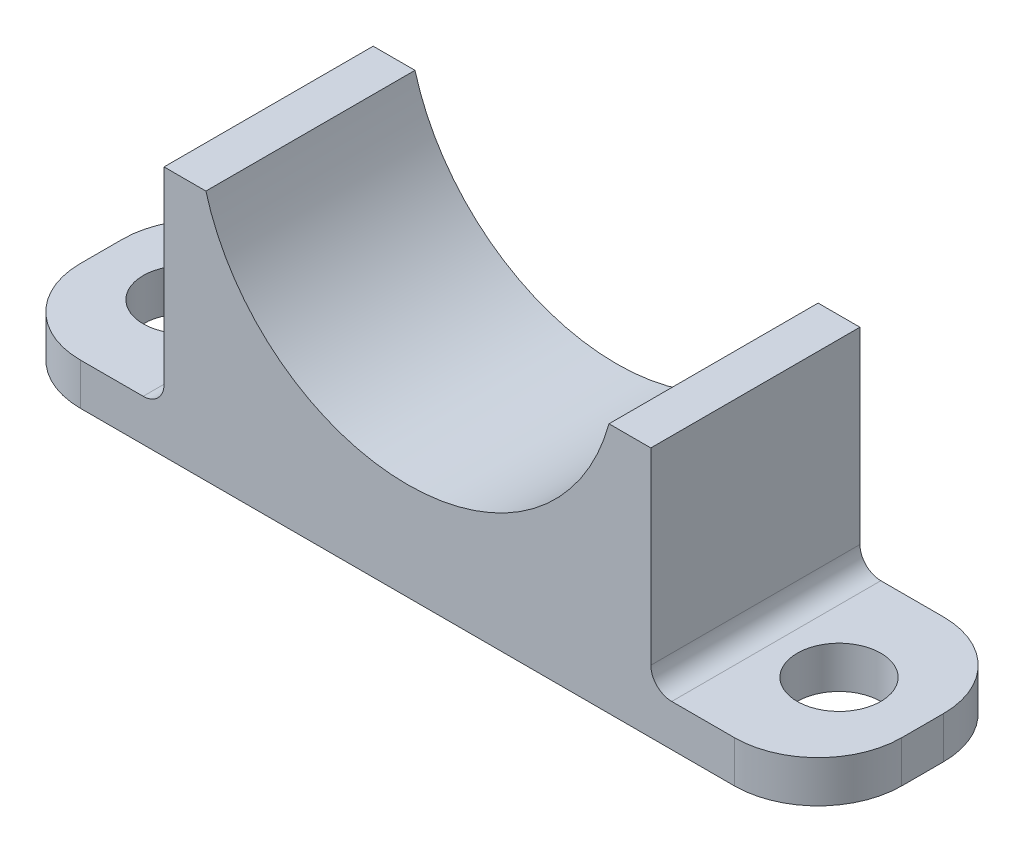
ISO-10303-21;
HEADER;
FILE_DESCRIPTION(('STEP AP214'),'2;1');
FILE_NAME('part.step','',(''),(''),'','','');
FILE_SCHEMA(('AUTOMOTIVE_DESIGN { 1 0 10303 214 1 1 1 1 }'));
ENDSEC;
DATA;
#1=APPLICATION_CONTEXT('core data for automotive mechanical design processes');
#2=APPLICATION_PROTOCOL_DEFINITION('international standard','automotive_design',2000,#1);
#3=PRODUCT_CONTEXT('',#1,'mechanical');
#4=PRODUCT('Part','Part','',(#3));
#5=PRODUCT_RELATED_PRODUCT_CATEGORY('part','',(#4));
#6=PRODUCT_DEFINITION_FORMATION('','',#4);
#7=PRODUCT_DEFINITION_CONTEXT('part definition',#1,'design');
#8=PRODUCT_DEFINITION('design','',#6,#7);
#9=PRODUCT_DEFINITION_SHAPE('','',#8);
#10=(LENGTH_UNIT() NAMED_UNIT(*) SI_UNIT(.MILLI.,.METRE.));
#11=(NAMED_UNIT(*) PLANE_ANGLE_UNIT() SI_UNIT($,.RADIAN.));
#12=(NAMED_UNIT(*) SI_UNIT($,.STERADIAN.) SOLID_ANGLE_UNIT());
#13=UNCERTAINTY_MEASURE_WITH_UNIT(LENGTH_MEASURE(1.E-05),#10,'distance_accuracy_value','');
#14=(GEOMETRIC_REPRESENTATION_CONTEXT(3) GLOBAL_UNCERTAINTY_ASSIGNED_CONTEXT((#13)) GLOBAL_UNIT_ASSIGNED_CONTEXT((#10,
#11,#12)) REPRESENTATION_CONTEXT('',''));
#15=CARTESIAN_POINT('',(0.,0.,0.));
#16=DIRECTION('',(0.,0.,1.));
#17=DIRECTION('',(1.,0.,0.));
#18=AXIS2_PLACEMENT_3D('',#15,#16,#17);
#19=CARTESIAN_POINT('',(31.59757972097,-29.1563241801685,25.));
#20=DIRECTION('',(0.,0.,1.));
#21=DIRECTION('',(1.,0.,0.));
#22=AXIS2_PLACEMENT_3D('',#19,#20,#21);
#23=CYLINDRICAL_SURFACE('',#22,2.5);
#24=DIRECTION('',(0.,0.,-1.));
#25=VECTOR('',#24,1.);
#26=CARTESIAN_POINT('',(29.09757972097,-29.1563241801685,25.));
#27=LINE('',#26,#25);
#28=CARTESIAN_POINT('',(29.09757972097,-29.1563241801685,25.));
#29=VERTEX_POINT('',#28);
#30=CARTESIAN_POINT('',(29.09757972097,-29.1563241801685,0.));
#31=VERTEX_POINT('',#30);
#32=EDGE_CURVE('E227',#29,#31,#27,.T.);
#33=ORIENTED_EDGE('',*,*,#32,.F.);
#34=CARTESIAN_POINT('',(31.59757972097,-29.1563241801685,25.));
#35=DIRECTION('',(0.,0.,1.));
#36=DIRECTION('',(1.,0.,0.));
#37=AXIS2_PLACEMENT_3D('',#34,#35,#36);
#38=CIRCLE('',#37,2.5);
#39=CARTESIAN_POINT('',(31.59757972097,-31.6563241801685,25.));
#40=VERTEX_POINT('',#39);
#41=EDGE_CURVE('E41',#29,#40,#38,.T.);
#42=ORIENTED_EDGE('',*,*,#41,.T.);
#43=DIRECTION('',(0.,0.,-1.));
#44=VECTOR('',#43,1.);
#45=CARTESIAN_POINT('',(31.59757972097,-31.6563241801685,25.));
#46=LINE('',#45,#44);
#47=CARTESIAN_POINT('',(31.59757972097,-31.6563241801685,0.));
#48=VERTEX_POINT('',#47);
#49=EDGE_CURVE('E230',#48,#40,#46,.F.);
#50=ORIENTED_EDGE('',*,*,#49,.F.);
#51=CARTESIAN_POINT('',(31.59757972097,-29.1563241801685,0.));
#52=DIRECTION('',(0.,0.,1.));
#53=DIRECTION('',(1.,0.,0.));
#54=AXIS2_PLACEMENT_3D('',#51,#52,#53);
#55=CIRCLE('',#54,2.5);
#56=EDGE_CURVE('E11',#48,#31,#55,.F.);
#57=ORIENTED_EDGE('',*,*,#56,.T.);
#58=EDGE_LOOP('',(#33,#42,#50,#57));
#59=FACE_BOUND('',#58,.T.);
#60=ADVANCED_FACE('F34',(#59),#23,.F.);
#61=CARTESIAN_POINT('',(-31.59757972097,-29.1563241801685,25.));
#62=DIRECTION('',(0.,0.,-1.));
#63=DIRECTION('',(-1.,0.,0.));
#64=AXIS2_PLACEMENT_3D('',#61,#62,#63);
#65=CYLINDRICAL_SURFACE('',#64,2.5);
#66=DIRECTION('',(0.,0.,1.));
#67=VECTOR('',#66,1.);
#68=CARTESIAN_POINT('',(-29.09757972097,-29.1563241801685,25.));
#69=LINE('',#68,#67);
#70=CARTESIAN_POINT('',(-29.09757972097,-29.1563241801685,0.));
#71=VERTEX_POINT('',#70);
#72=CARTESIAN_POINT('',(-29.09757972097,-29.1563241801685,25.));
#73=VERTEX_POINT('',#72);
#74=EDGE_CURVE('E217',#71,#73,#69,.T.);
#75=ORIENTED_EDGE('',*,*,#74,.F.);
#76=CARTESIAN_POINT('',(-31.59757972097,-29.1563241801685,0.));
#77=DIRECTION('',(0.,0.,1.));
#78=DIRECTION('',(1.,0.,0.));
#79=AXIS2_PLACEMENT_3D('',#76,#77,#78);
#80=CIRCLE('',#79,2.5);
#81=CARTESIAN_POINT('',(-31.59757972097,-31.6563241801685,0.));
#82=VERTEX_POINT('',#81);
#83=EDGE_CURVE('E223',#71,#82,#80,.F.);
#84=ORIENTED_EDGE('',*,*,#83,.T.);
#85=DIRECTION('',(0.,0.,1.));
#86=VECTOR('',#85,1.);
#87=CARTESIAN_POINT('',(-31.59757972097,-31.6563241801685,25.));
#88=LINE('',#87,#86);
#89=CARTESIAN_POINT('',(-31.59757972097,-31.6563241801685,25.));
#90=VERTEX_POINT('',#89);
#91=EDGE_CURVE('E220',#90,#82,#88,.F.);
#92=ORIENTED_EDGE('',*,*,#91,.F.);
#93=CARTESIAN_POINT('',(-31.59757972097,-29.1563241801685,25.));
#94=DIRECTION('',(0.,0.,1.));
#95=DIRECTION('',(1.,0.,0.));
#96=AXIS2_PLACEMENT_3D('',#93,#94,#95);
#97=CIRCLE('',#96,2.5);
#98=EDGE_CURVE('E225',#90,#73,#97,.T.);
#99=ORIENTED_EDGE('',*,*,#98,.T.);
#100=EDGE_LOOP('',(#75,#84,#92,#99));
#101=FACE_BOUND('',#100,.T.);
#102=ADVANCED_FACE('F292',(#101),#65,.F.);
#103=CARTESIAN_POINT('',(39.09757972097,0.,10.));
#104=DIRECTION('',(0.,-1.,0.));
#105=DIRECTION('',(0.,0.,-1.));
#106=AXIS2_PLACEMENT_3D('',#103,#104,#105);
#107=CYLINDRICAL_SURFACE('',#106,10.);
#108=DIRECTION('',(0.,-1.,0.));
#109=VECTOR('',#108,1.);
#110=CARTESIAN_POINT('',(39.09757972097,0.,0.));
#111=LINE('',#110,#109);
#112=CARTESIAN_POINT('',(39.09757972097,-31.6563241801685,0.));
#113=VERTEX_POINT('',#112);
#114=CARTESIAN_POINT('',(39.09757972097,-36.6563241801685,0.));
#115=VERTEX_POINT('',#114);
#116=EDGE_CURVE('E207',#113,#115,#111,.T.);
#117=ORIENTED_EDGE('',*,*,#116,.F.);
#118=CARTESIAN_POINT('',(39.09757972097,-31.6563241801685,10.));
#119=DIRECTION('',(0.,-1.,0.));
#120=DIRECTION('',(1.,0.,0.));
#121=AXIS2_PLACEMENT_3D('',#118,#119,#120);
#122=CIRCLE('',#121,10.);
#123=CARTESIAN_POINT('',(49.09757972097,-31.6563241801685,10.));
#124=VERTEX_POINT('',#123);
#125=EDGE_CURVE('E213',#124,#113,#122,.F.);
#126=ORIENTED_EDGE('',*,*,#125,.F.);
#127=DIRECTION('',(0.,-1.,0.));
#128=VECTOR('',#127,1.);
#129=CARTESIAN_POINT('',(49.09757972097,0.,10.));
#130=LINE('',#129,#128);
#131=CARTESIAN_POINT('',(49.09757972097,-36.6563241801685,10.));
#132=VERTEX_POINT('',#131);
#133=EDGE_CURVE('E210',#132,#124,#130,.F.);
#134=ORIENTED_EDGE('',*,*,#133,.F.);
#135=CARTESIAN_POINT('',(39.09757972097,-36.6563241801685,10.));
#136=DIRECTION('',(0.,1.,0.));
#137=DIRECTION('',(-1.,0.,0.));
#138=AXIS2_PLACEMENT_3D('',#135,#136,#137);
#139=CIRCLE('',#138,10.);
#140=EDGE_CURVE('E215',#115,#132,#139,.F.);
#141=ORIENTED_EDGE('',*,*,#140,.F.);
#142=EDGE_LOOP('',(#117,#126,#134,#141));
#143=FACE_BOUND('',#142,.T.);
#144=ADVANCED_FACE('F316',(#143),#107,.T.);
#145=CARTESIAN_POINT('',(39.09757972097,0.,15.));
#146=DIRECTION('',(0.,-1.,0.));
#147=DIRECTION('',(0.,0.,-1.));
#148=AXIS2_PLACEMENT_3D('',#145,#146,#147);
#149=CYLINDRICAL_SURFACE('',#148,10.);
#150=DIRECTION('',(0.,1.,0.));
#151=VECTOR('',#150,1.);
#152=CARTESIAN_POINT('',(39.09757972097,0.,25.));
#153=LINE('',#152,#151);
#154=CARTESIAN_POINT('',(39.09757972097,-36.6563241801685,25.));
#155=VERTEX_POINT('',#154);
#156=CARTESIAN_POINT('',(39.09757972097,-31.6563241801685,25.));
#157=VERTEX_POINT('',#156);
#158=EDGE_CURVE('E196',#155,#157,#153,.T.);
#159=ORIENTED_EDGE('',*,*,#158,.F.);
#160=CARTESIAN_POINT('',(39.09757972097,-36.6563241801685,15.));
#161=DIRECTION('',(0.,1.,0.));
#162=DIRECTION('',(-1.,0.,0.));
#163=AXIS2_PLACEMENT_3D('',#160,#161,#162);
#164=CIRCLE('',#163,10.);
#165=CARTESIAN_POINT('',(49.09757972097,-36.6563241801685,15.));
#166=VERTEX_POINT('',#165);
#167=EDGE_CURVE('E202',#166,#155,#164,.F.);
#168=ORIENTED_EDGE('',*,*,#167,.F.);
#169=DIRECTION('',(0.,1.,0.));
#170=VECTOR('',#169,1.);
#171=CARTESIAN_POINT('',(49.09757972097,0.,15.));
#172=LINE('',#171,#170);
#173=CARTESIAN_POINT('',(49.09757972097,-31.6563241801685,15.));
#174=VERTEX_POINT('',#173);
#175=EDGE_CURVE('E199',#174,#166,#172,.F.);
#176=ORIENTED_EDGE('',*,*,#175,.F.);
#177=CARTESIAN_POINT('',(39.09757972097,-31.6563241801685,15.));
#178=DIRECTION('',(0.,-1.,0.));
#179=DIRECTION('',(1.,0.,0.));
#180=AXIS2_PLACEMENT_3D('',#177,#178,#179);
#181=CIRCLE('',#180,10.);
#182=EDGE_CURVE('E204',#157,#174,#181,.F.);
#183=ORIENTED_EDGE('',*,*,#182,.F.);
#184=EDGE_LOOP('',(#159,#168,#176,#183));
#185=FACE_BOUND('',#184,.T.);
#186=ADVANCED_FACE('F309',(#185),#149,.T.);
#187=CARTESIAN_POINT('',(29.09757972097,-6.6563241801685,25.));
#188=DIRECTION('',(-1.,0.,0.));
#189=DIRECTION('',(0.,-1.,0.));
#190=AXIS2_PLACEMENT_3D('',#187,#188,#189);
#191=PLANE('',#190);
#192=DIRECTION('',(0.,1.,0.));
#193=VECTOR('',#192,1.);
#194=CARTESIAN_POINT('',(29.09757972097,-6.6563241801685,25.));
#195=LINE('',#194,#193);
#196=CARTESIAN_POINT('',(29.09757972097,-6.6563241801685,25.));
#197=VERTEX_POINT('',#196);
#198=EDGE_CURVE('E261',#29,#197,#195,.T.);
#199=ORIENTED_EDGE('',*,*,#198,.F.);
#200=ORIENTED_EDGE('',*,*,#32,.T.);
#201=DIRECTION('',(0.,1.,0.));
#202=VECTOR('',#201,1.);
#203=CARTESIAN_POINT('',(29.09757972097,-6.6563241801685,0.));
#204=LINE('',#203,#202);
#205=CARTESIAN_POINT('',(29.09757972097,-6.6563241801685,0.));
#206=VERTEX_POINT('',#205);
#207=EDGE_CURVE('E274',#31,#206,#204,.T.);
#208=ORIENTED_EDGE('',*,*,#207,.T.);
#209=DIRECTION('',(0.,0.,-1.));
#210=VECTOR('',#209,1.);
#211=CARTESIAN_POINT('',(29.09757972097,-6.6563241801685,25.));
#212=LINE('',#211,#210);
#213=EDGE_CURVE('E175',#197,#206,#212,.T.);
#214=ORIENTED_EDGE('',*,*,#213,.F.);
#215=EDGE_LOOP('',(#199,#200,#208,#214));
#216=FACE_BOUND('',#215,.T.);
#217=ADVANCED_FACE('F338',(#216),#191,.F.);
#218=CARTESIAN_POINT('',(-39.09757972097,0.,10.));
#219=DIRECTION('',(0.,1.,0.));
#220=DIRECTION('',(0.,0.,1.));
#221=AXIS2_PLACEMENT_3D('',#218,#219,#220);
#222=CYLINDRICAL_SURFACE('',#221,10.);
#223=DIRECTION('',(0.,1.,0.));
#224=VECTOR('',#223,1.);
#225=CARTESIAN_POINT('',(-39.09757972097,0.,0.));
#226=LINE('',#225,#224);
#227=CARTESIAN_POINT('',(-39.09757972097,-36.6563241801685,0.));
#228=VERTEX_POINT('',#227);
#229=CARTESIAN_POINT('',(-39.09757972097,-31.6563241801685,0.));
#230=VERTEX_POINT('',#229);
#231=EDGE_CURVE('E186',#228,#230,#226,.T.);
#232=ORIENTED_EDGE('',*,*,#231,.F.);
#233=CARTESIAN_POINT('',(-39.09757972097,-36.6563241801685,10.));
#234=DIRECTION('',(0.,1.,0.));
#235=DIRECTION('',(-1.,0.,0.));
#236=AXIS2_PLACEMENT_3D('',#233,#234,#235);
#237=CIRCLE('',#236,10.);
#238=CARTESIAN_POINT('',(-49.09757972097,-36.6563241801685,10.));
#239=VERTEX_POINT('',#238);
#240=EDGE_CURVE('E192',#239,#228,#237,.F.);
#241=ORIENTED_EDGE('',*,*,#240,.F.);
#242=DIRECTION('',(0.,1.,0.));
#243=VECTOR('',#242,1.);
#244=CARTESIAN_POINT('',(-49.09757972097,0.,10.));
#245=LINE('',#244,#243);
#246=CARTESIAN_POINT('',(-49.09757972097,-31.6563241801685,10.));
#247=VERTEX_POINT('',#246);
#248=EDGE_CURVE('E189',#247,#239,#245,.F.);
#249=ORIENTED_EDGE('',*,*,#248,.F.);
#250=CARTESIAN_POINT('',(-39.09757972097,-31.6563241801685,10.));
#251=DIRECTION('',(0.,-1.,0.));
#252=DIRECTION('',(0.,0.,-1.));
#253=AXIS2_PLACEMENT_3D('',#250,#251,#252);
#254=CIRCLE('',#253,10.);
#255=EDGE_CURVE('E194',#230,#247,#254,.F.);
#256=ORIENTED_EDGE('',*,*,#255,.F.);
#257=EDGE_LOOP('',(#232,#241,#249,#256));
#258=FACE_BOUND('',#257,.T.);
#259=ADVANCED_FACE('F321',(#258),#222,.T.);
#260=CARTESIAN_POINT('',(-39.09757972097,0.,15.));
#261=DIRECTION('',(0.,1.,0.));
#262=DIRECTION('',(0.,0.,1.));
#263=AXIS2_PLACEMENT_3D('',#260,#261,#262);
#264=CYLINDRICAL_SURFACE('',#263,10.);
#265=DIRECTION('',(0.,-1.,0.));
#266=VECTOR('',#265,1.);
#267=CARTESIAN_POINT('',(-39.09757972097,0.,25.));
#268=LINE('',#267,#266);
#269=CARTESIAN_POINT('',(-39.09757972097,-31.6563241801685,25.));
#270=VERTEX_POINT('',#269);
#271=CARTESIAN_POINT('',(-39.09757972097,-36.6563241801685,25.));
#272=VERTEX_POINT('',#271);
#273=EDGE_CURVE('E170',#270,#272,#268,.T.);
#274=ORIENTED_EDGE('',*,*,#273,.F.);
#275=CARTESIAN_POINT('',(-39.09757972097,-31.6563241801685,15.));
#276=DIRECTION('',(0.,-1.,0.));
#277=DIRECTION('',(0.,0.,-1.));
#278=AXIS2_PLACEMENT_3D('',#275,#276,#277);
#279=CIRCLE('',#278,10.);
#280=CARTESIAN_POINT('',(-49.09757972097,-31.6563241801685,15.));
#281=VERTEX_POINT('',#280);
#282=EDGE_CURVE('E181',#281,#270,#279,.F.);
#283=ORIENTED_EDGE('',*,*,#282,.F.);
#284=DIRECTION('',(0.,-1.,0.));
#285=VECTOR('',#284,1.);
#286=CARTESIAN_POINT('',(-49.09757972097,0.,15.));
#287=LINE('',#286,#285);
#288=CARTESIAN_POINT('',(-49.09757972097,-36.6563241801685,15.));
#289=VERTEX_POINT('',#288);
#290=EDGE_CURVE('E173',#289,#281,#287,.F.);
#291=ORIENTED_EDGE('',*,*,#290,.F.);
#292=CARTESIAN_POINT('',(-39.09757972097,-36.6563241801685,15.));
#293=DIRECTION('',(0.,1.,0.));
#294=DIRECTION('',(-1.,0.,0.));
#295=AXIS2_PLACEMENT_3D('',#292,#293,#294);
#296=CIRCLE('',#295,10.);
#297=EDGE_CURVE('E183',#272,#289,#296,.F.);
#298=ORIENTED_EDGE('',*,*,#297,.F.);
#299=EDGE_LOOP('',(#274,#283,#291,#298));
#300=FACE_BOUND('',#299,.T.);
#301=ADVANCED_FACE('F300',(#300),#264,.T.);
#302=CARTESIAN_POINT('',(-29.09757972097,-36.6563241801685,25.));
#303=DIRECTION('',(1.,0.,0.));
#304=DIRECTION('',(0.,0.,-1.));
#305=AXIS2_PLACEMENT_3D('',#302,#303,#304);
#306=PLANE('',#305);
#307=DIRECTION('',(0.,-1.,0.));
#308=VECTOR('',#307,1.);
#309=CARTESIAN_POINT('',(-29.09757972097,-36.6563241801685,0.));
#310=LINE('',#309,#308);
#311=CARTESIAN_POINT('',(-29.09757972097,-6.6563241801685,0.));
#312=VERTEX_POINT('',#311);
#313=EDGE_CURVE('E268',#312,#71,#310,.T.);
#314=ORIENTED_EDGE('',*,*,#313,.T.);
#315=ORIENTED_EDGE('',*,*,#74,.T.);
#316=DIRECTION('',(0.,-1.,0.));
#317=VECTOR('',#316,1.);
#318=CARTESIAN_POINT('',(-29.09757972097,-36.6563241801685,25.));
#319=LINE('',#318,#317);
#320=CARTESIAN_POINT('',(-29.09757972097,-6.6563241801685,25.));
#321=VERTEX_POINT('',#320);
#322=EDGE_CURVE('E155',#321,#73,#319,.T.);
#323=ORIENTED_EDGE('',*,*,#322,.F.);
#324=DIRECTION('',(0.,0.,-1.));
#325=VECTOR('',#324,1.);
#326=CARTESIAN_POINT('',(-29.09757972097,-6.6563241801685,25.));
#327=LINE('',#326,#325);
#328=EDGE_CURVE('E151',#321,#312,#327,.T.);
#329=ORIENTED_EDGE('',*,*,#328,.T.);
#330=EDGE_LOOP('',(#314,#315,#323,#329));
#331=FACE_BOUND('',#330,.T.);
#332=ADVANCED_FACE('F287',(#331),#306,.F.);
#333=CARTESIAN_POINT('',(0.,0.,25.));
#334=DIRECTION('',(0.,0.,-1.));
#335=DIRECTION('',(-1.,0.,0.));
#336=AXIS2_PLACEMENT_3D('',#333,#334,#335);
#337=CYLINDRICAL_SURFACE('',#336,25.);
#338=CARTESIAN_POINT('',(0.,0.,0.));
#339=DIRECTION('',(0.,0.,-1.));
#340=DIRECTION('',(1.,0.,0.));
#341=AXIS2_PLACEMENT_3D('',#338,#339,#340);
#342=CIRCLE('',#341,25.);
#343=CARTESIAN_POINT('',(24.09757972097,-6.6563241801685,0.));
#344=VERTEX_POINT('',#343);
#345=CARTESIAN_POINT('',(-24.09757972097,-6.6563241801685,0.));
#346=VERTEX_POINT('',#345);
#347=EDGE_CURVE('E169',#344,#346,#342,.T.);
#348=ORIENTED_EDGE('',*,*,#347,.T.);
#349=DIRECTION('',(0.,0.,-1.));
#350=VECTOR('',#349,1.);
#351=CARTESIAN_POINT('',(-24.09757972097,-6.6563241801685,25.));
#352=LINE('',#351,#350);
#353=CARTESIAN_POINT('',(-24.09757972097,-6.6563241801685,25.));
#354=VERTEX_POINT('',#353);
#355=EDGE_CURVE('E148',#354,#346,#352,.T.);
#356=ORIENTED_EDGE('',*,*,#355,.F.);
#357=CARTESIAN_POINT('',(0.,0.,25.));
#358=DIRECTION('',(0.,0.,-1.));
#359=DIRECTION('',(1.,0.,0.));
#360=AXIS2_PLACEMENT_3D('',#357,#358,#359);
#361=CIRCLE('',#360,25.);
#362=CARTESIAN_POINT('',(24.09757972097,-6.6563241801685,25.));
#363=VERTEX_POINT('',#362);
#364=EDGE_CURVE('E156',#363,#354,#361,.T.);
#365=ORIENTED_EDGE('',*,*,#364,.F.);
#366=DIRECTION('',(0.,0.,-1.));
#367=VECTOR('',#366,1.);
#368=CARTESIAN_POINT('',(24.09757972097,-6.6563241801685,25.));
#369=LINE('',#368,#367);
#370=EDGE_CURVE('E264',#363,#344,#369,.T.);
#371=ORIENTED_EDGE('',*,*,#370,.T.);
#372=EDGE_LOOP('',(#348,#356,#365,#371));
#373=FACE_BOUND('',#372,.T.);
#374=ADVANCED_FACE('F167',(#373),#337,.F.);
#375=CARTESIAN_POINT('',(-29.09757972097,-6.6563241801685,25.));
#376=DIRECTION('',(0.,-1.,0.));
#377=DIRECTION('',(0.,0.,-1.));
#378=AXIS2_PLACEMENT_3D('',#375,#376,#377);
#379=PLANE('',#378);
#380=DIRECTION('',(-1.,0.,0.));
#381=VECTOR('',#380,1.);
#382=CARTESIAN_POINT('',(-29.09757972097,-6.6563241801685,0.));
#383=LINE('',#382,#381);
#384=EDGE_CURVE('E266',#346,#312,#383,.T.);
#385=ORIENTED_EDGE('',*,*,#384,.T.);
#386=ORIENTED_EDGE('',*,*,#328,.F.);
#387=DIRECTION('',(-1.,0.,0.));
#388=VECTOR('',#387,1.);
#389=CARTESIAN_POINT('',(-29.09757972097,-6.6563241801685,25.));
#390=LINE('',#389,#388);
#391=EDGE_CURVE('E144',#354,#321,#390,.T.);
#392=ORIENTED_EDGE('',*,*,#391,.F.);
#393=ORIENTED_EDGE('',*,*,#355,.T.);
#394=EDGE_LOOP('',(#385,#386,#392,#393));
#395=FACE_BOUND('',#394,.T.);
#396=ADVANCED_FACE('F146',(#395),#379,.F.);
#397=CARTESIAN_POINT('',(29.09757972097,-36.6563241801685,25.));
#398=DIRECTION('',(0.,1.,0.));
#399=DIRECTION('',(-1.,0.,0.));
#400=AXIS2_PLACEMENT_3D('',#397,#398,#399);
#401=PLANE('',#400);
#402=CARTESIAN_POINT('',(39.09757972097,-36.6563241801685,12.5));
#403=DIRECTION('',(0.,1.,0.));
#404=DIRECTION('',(-1.,0.,0.));
#405=AXIS2_PLACEMENT_3D('',#402,#403,#404);
#406=CIRCLE('',#405,5.);
#407=CARTESIAN_POINT('',(34.09757972097,-36.6563241801685,12.5));
#408=VERTEX_POINT('',#407);
#409=EDGE_CURVE('E498',#408,#408,#406,.T.);
#410=ORIENTED_EDGE('',*,*,#409,.T.);
#411=EDGE_LOOP('',(#410));
#412=FACE_BOUND('',#411,.T.);
#413=CARTESIAN_POINT('',(-39.09757972097,-36.6563241801685,12.5));
#414=DIRECTION('',(0.,1.,0.));
#415=DIRECTION('',(-1.,0.,0.));
#416=AXIS2_PLACEMENT_3D('',#413,#414,#415);
#417=CIRCLE('',#416,5.);
#418=CARTESIAN_POINT('',(-44.09757972097,-36.6563241801685,12.5));
#419=VERTEX_POINT('',#418);
#420=EDGE_CURVE('E496',#419,#419,#417,.T.);
#421=ORIENTED_EDGE('',*,*,#420,.T.);
#422=EDGE_LOOP('',(#421));
#423=FACE_BOUND('',#422,.T.);
#424=DIRECTION('',(1.,0.,0.));
#425=VECTOR('',#424,1.);
#426=CARTESIAN_POINT('',(29.09757972097,-36.6563241801685,0.));
#427=LINE('',#426,#425);
#428=EDGE_CURVE('E271',#228,#115,#427,.T.);
#429=ORIENTED_EDGE('',*,*,#428,.T.);
#430=ORIENTED_EDGE('',*,*,#140,.T.);
#431=DIRECTION('',(0.,0.,-1.));
#432=VECTOR('',#431,1.);
#433=CARTESIAN_POINT('',(49.09757972097,-36.6563241801685,25.));
#434=LINE('',#433,#432);
#435=EDGE_CURVE('E244',#166,#132,#434,.T.);
#436=ORIENTED_EDGE('',*,*,#435,.F.);
#437=ORIENTED_EDGE('',*,*,#167,.T.);
#438=DIRECTION('',(1.,0.,0.));
#439=VECTOR('',#438,1.);
#440=CARTESIAN_POINT('',(29.09757972097,-36.6563241801685,25.));
#441=LINE('',#440,#439);
#442=EDGE_CURVE('E259',#272,#155,#441,.T.);
#443=ORIENTED_EDGE('',*,*,#442,.F.);
#444=ORIENTED_EDGE('',*,*,#297,.T.);
#445=DIRECTION('',(0.,0.,1.));
#446=VECTOR('',#445,1.);
#447=CARTESIAN_POINT('',(-49.09757972097,-36.6563241801685,0.));
#448=LINE('',#447,#446);
#449=EDGE_CURVE('E242',#239,#289,#448,.T.);
#450=ORIENTED_EDGE('',*,*,#449,.F.);
#451=ORIENTED_EDGE('',*,*,#240,.T.);
#452=EDGE_LOOP('',(#429,#430,#436,#437,#443,#444,#450,#451));
#453=FACE_BOUND('',#452,.T.);
#454=ADVANCED_FACE('F303',(#412,#423,#453),#401,.F.);
#455=CARTESIAN_POINT('',(24.09757972097,-6.6563241801685,25.));
#456=DIRECTION('',(0.,-1.,0.));
#457=DIRECTION('',(0.,0.,-1.));
#458=AXIS2_PLACEMENT_3D('',#455,#456,#457);
#459=PLANE('',#458);
#460=DIRECTION('',(-1.,0.,0.));
#461=VECTOR('',#460,1.);
#462=CARTESIAN_POINT('',(24.09757972097,-6.6563241801685,0.));
#463=LINE('',#462,#461);
#464=EDGE_CURVE('E165',#206,#344,#463,.T.);
#465=ORIENTED_EDGE('',*,*,#464,.T.);
#466=ORIENTED_EDGE('',*,*,#370,.F.);
#467=DIRECTION('',(-1.,0.,0.));
#468=VECTOR('',#467,1.);
#469=CARTESIAN_POINT('',(24.09757972097,-6.6563241801685,25.));
#470=LINE('',#469,#468);
#471=EDGE_CURVE('E161',#197,#363,#470,.T.);
#472=ORIENTED_EDGE('',*,*,#471,.F.);
#473=ORIENTED_EDGE('',*,*,#213,.T.);
#474=EDGE_LOOP('',(#465,#466,#472,#473));
#475=FACE_BOUND('',#474,.T.);
#476=ADVANCED_FACE('F281',(#475),#459,.F.);
#477=CARTESIAN_POINT('',(0.,0.,25.));
#478=DIRECTION('',(0.,0.,1.));
#479=DIRECTION('',(1.,0.,0.));
#480=AXIS2_PLACEMENT_3D('',#477,#478,#479);
#481=PLANE('',#480);
#482=ORIENTED_EDGE('',*,*,#41,.F.);
#483=ORIENTED_EDGE('',*,*,#198,.T.);
#484=ORIENTED_EDGE('',*,*,#471,.T.);
#485=ORIENTED_EDGE('',*,*,#364,.T.);
#486=ORIENTED_EDGE('',*,*,#391,.T.);
#487=ORIENTED_EDGE('',*,*,#322,.T.);
#488=ORIENTED_EDGE('',*,*,#98,.F.);
#489=DIRECTION('',(1.,0.,0.));
#490=VECTOR('',#489,1.);
#491=CARTESIAN_POINT('',(-49.09757972097,-31.6563241801685,25.));
#492=LINE('',#491,#490);
#493=EDGE_CURVE('E255',#270,#90,#492,.T.);
#494=ORIENTED_EDGE('',*,*,#493,.F.);
#495=ORIENTED_EDGE('',*,*,#273,.T.);
#496=ORIENTED_EDGE('',*,*,#442,.T.);
#497=ORIENTED_EDGE('',*,*,#158,.T.);
#498=DIRECTION('',(-1.,0.,0.));
#499=VECTOR('',#498,1.);
#500=CARTESIAN_POINT('',(49.09757972097,-31.6563241801685,25.));
#501=LINE('',#500,#499);
#502=EDGE_CURVE('E236',#157,#40,#501,.T.);
#503=ORIENTED_EDGE('',*,*,#502,.T.);
#504=EDGE_LOOP('',(#482,#483,#484,#485,#486,#487,#488,#494,#495,#496,#497,#503));
#505=FACE_BOUND('',#504,.T.);
#506=ADVANCED_FACE('F159',(#505),#481,.T.);
#507=CARTESIAN_POINT('',(0.,0.,0.));
#508=DIRECTION('',(0.,0.,1.));
#509=DIRECTION('',(1.,0.,0.));
#510=AXIS2_PLACEMENT_3D('',#507,#508,#509);
#511=PLANE('',#510);
#512=DIRECTION('',(-1.,0.,0.));
#513=VECTOR('',#512,1.);
#514=CARTESIAN_POINT('',(49.09757972097,-31.6563241801685,0.));
#515=LINE('',#514,#513);
#516=EDGE_CURVE('E237',#113,#48,#515,.T.);
#517=ORIENTED_EDGE('',*,*,#516,.F.);
#518=ORIENTED_EDGE('',*,*,#116,.T.);
#519=ORIENTED_EDGE('',*,*,#428,.F.);
#520=ORIENTED_EDGE('',*,*,#231,.T.);
#521=DIRECTION('',(1.,0.,0.));
#522=VECTOR('',#521,1.);
#523=CARTESIAN_POINT('',(-49.09757972097,-31.6563241801685,0.));
#524=LINE('',#523,#522);
#525=EDGE_CURVE('E252',#230,#82,#524,.T.);
#526=ORIENTED_EDGE('',*,*,#525,.T.);
#527=ORIENTED_EDGE('',*,*,#83,.F.);
#528=ORIENTED_EDGE('',*,*,#313,.F.);
#529=ORIENTED_EDGE('',*,*,#384,.F.);
#530=ORIENTED_EDGE('',*,*,#347,.F.);
#531=ORIENTED_EDGE('',*,*,#464,.F.);
#532=ORIENTED_EDGE('',*,*,#207,.F.);
#533=ORIENTED_EDGE('',*,*,#56,.F.);
#534=EDGE_LOOP('',(#517,#518,#519,#520,#526,#527,#528,#529,#530,#531,#532,#533));
#535=FACE_BOUND('',#534,.T.);
#536=ADVANCED_FACE('F284',(#535),#511,.F.);
#537=CARTESIAN_POINT('',(-49.09757972097,-31.6563241801685,0.));
#538=DIRECTION('',(0.,-1.,0.));
#539=DIRECTION('',(0.,0.,-1.));
#540=AXIS2_PLACEMENT_3D('',#537,#538,#539);
#541=PLANE('',#540);
#542=CARTESIAN_POINT('',(-39.09757972097,-31.6563241801685,12.5));
#543=DIRECTION('',(0.,1.,0.));
#544=DIRECTION('',(1.,0.,0.));
#545=AXIS2_PLACEMENT_3D('',#542,#543,#544);
#546=CIRCLE('',#545,5.);
#547=CARTESIAN_POINT('',(-34.09757972097,-31.6563241801685,12.5));
#548=VERTEX_POINT('',#547);
#549=EDGE_CURVE('E493',#548,#548,#546,.T.);
#550=ORIENTED_EDGE('',*,*,#549,.F.);
#551=EDGE_LOOP('',(#550));
#552=FACE_BOUND('',#551,.T.);
#553=ORIENTED_EDGE('',*,*,#493,.T.);
#554=ORIENTED_EDGE('',*,*,#91,.T.);
#555=ORIENTED_EDGE('',*,*,#525,.F.);
#556=ORIENTED_EDGE('',*,*,#255,.T.);
#557=DIRECTION('',(0.,0.,-1.));
#558=VECTOR('',#557,1.);
#559=CARTESIAN_POINT('',(-49.09757972097,-31.6563241801685,0.));
#560=LINE('',#559,#558);
#561=EDGE_CURVE('E249',#281,#247,#560,.T.);
#562=ORIENTED_EDGE('',*,*,#561,.F.);
#563=ORIENTED_EDGE('',*,*,#282,.T.);
#564=EDGE_LOOP('',(#553,#554,#555,#556,#562,#563));
#565=FACE_BOUND('',#564,.T.);
#566=ADVANCED_FACE('F295',(#552,#565),#541,.F.);
#567=CARTESIAN_POINT('',(-49.09757972097,0.,0.));
#568=DIRECTION('',(1.,0.,0.));
#569=DIRECTION('',(0.,0.,-1.));
#570=AXIS2_PLACEMENT_3D('',#567,#568,#569);
#571=PLANE('',#570);
#572=ORIENTED_EDGE('',*,*,#561,.T.);
#573=ORIENTED_EDGE('',*,*,#248,.T.);
#574=ORIENTED_EDGE('',*,*,#449,.T.);
#575=ORIENTED_EDGE('',*,*,#290,.T.);
#576=EDGE_LOOP('',(#572,#573,#574,#575));
#577=FACE_BOUND('',#576,.T.);
#578=ADVANCED_FACE('F323',(#577),#571,.F.);
#579=CARTESIAN_POINT('',(49.09757972097,-31.6563241801685,25.));
#580=DIRECTION('',(0.,-1.,0.));
#581=DIRECTION('',(1.,0.,0.));
#582=AXIS2_PLACEMENT_3D('',#579,#580,#581);
#583=PLANE('',#582);
#584=CARTESIAN_POINT('',(39.09757972097,-31.6563241801685,12.5));
#585=DIRECTION('',(0.,1.,0.));
#586=DIRECTION('',(-1.,0.,0.));
#587=AXIS2_PLACEMENT_3D('',#584,#585,#586);
#588=CIRCLE('',#587,5.);
#589=CARTESIAN_POINT('',(34.09757972097,-31.6563241801685,12.5));
#590=VERTEX_POINT('',#589);
#591=EDGE_CURVE('E501',#590,#590,#588,.T.);
#592=ORIENTED_EDGE('',*,*,#591,.F.);
#593=EDGE_LOOP('',(#592));
#594=FACE_BOUND('',#593,.T.);
#595=ORIENTED_EDGE('',*,*,#516,.T.);
#596=ORIENTED_EDGE('',*,*,#49,.T.);
#597=ORIENTED_EDGE('',*,*,#502,.F.);
#598=ORIENTED_EDGE('',*,*,#182,.T.);
#599=DIRECTION('',(0.,0.,1.));
#600=VECTOR('',#599,1.);
#601=CARTESIAN_POINT('',(49.09757972097,-31.6563241801685,25.));
#602=LINE('',#601,#600);
#603=EDGE_CURVE('E240',#124,#174,#602,.T.);
#604=ORIENTED_EDGE('',*,*,#603,.F.);
#605=ORIENTED_EDGE('',*,*,#125,.T.);
#606=EDGE_LOOP('',(#595,#596,#597,#598,#604,#605));
#607=FACE_BOUND('',#606,.T.);
#608=ADVANCED_FACE('F235',(#594,#607),#583,.F.);
#609=CARTESIAN_POINT('',(49.09757972097,0.,0.));
#610=DIRECTION('',(-1.,0.,0.));
#611=DIRECTION('',(0.,0.,1.));
#612=AXIS2_PLACEMENT_3D('',#609,#610,#611);
#613=PLANE('',#612);
#614=ORIENTED_EDGE('',*,*,#435,.T.);
#615=ORIENTED_EDGE('',*,*,#133,.T.);
#616=ORIENTED_EDGE('',*,*,#603,.T.);
#617=ORIENTED_EDGE('',*,*,#175,.T.);
#618=EDGE_LOOP('',(#614,#615,#616,#617));
#619=FACE_BOUND('',#618,.T.);
#620=ADVANCED_FACE('F313',(#619),#613,.F.);
#621=CARTESIAN_POINT('',(39.09757972097,-51.6563241801685,12.5));
#622=DIRECTION('',(0.,1.,0.));
#623=DIRECTION('',(-1.,0.,0.));
#624=AXIS2_PLACEMENT_3D('',#621,#622,#623);
#625=CYLINDRICAL_SURFACE('',#624,5.);
#626=ORIENTED_EDGE('',*,*,#591,.T.);
#627=EDGE_LOOP('',(#626));
#628=FACE_BOUND('',#627,.T.);
#629=ORIENTED_EDGE('',*,*,#409,.F.);
#630=EDGE_LOOP('',(#629));
#631=FACE_BOUND('',#630,.T.);
#632=ADVANCED_FACE('F465',(#628,#631),#625,.F.);
#633=CARTESIAN_POINT('',(-39.09757972097,-51.6563241801685,12.5));
#634=DIRECTION('',(0.,1.,0.));
#635=DIRECTION('',(-1.,0.,0.));
#636=AXIS2_PLACEMENT_3D('',#633,#634,#635);
#637=CYLINDRICAL_SURFACE('',#636,5.);
#638=ORIENTED_EDGE('',*,*,#549,.T.);
#639=EDGE_LOOP('',(#638));
#640=FACE_BOUND('',#639,.T.);
#641=ORIENTED_EDGE('',*,*,#420,.F.);
#642=EDGE_LOOP('',(#641));
#643=FACE_BOUND('',#642,.T.);
#644=ADVANCED_FACE('F472',(#640,#643),#637,.F.);
#645=CLOSED_SHELL('',(#60,#102,#144,#186,#217,#259,#301,#332,#374,#396,#454,#476,#506,#536,#566,
#578,#608,#620,#632,#644));
#646=MANIFOLD_SOLID_BREP('B2',#645);
#647=ADVANCED_BREP_SHAPE_REPRESENTATION('',(#18,#646),#14);
#648=SHAPE_DEFINITION_REPRESENTATION(#9,#647);
ENDSEC;
END-ISO-10303-21;
